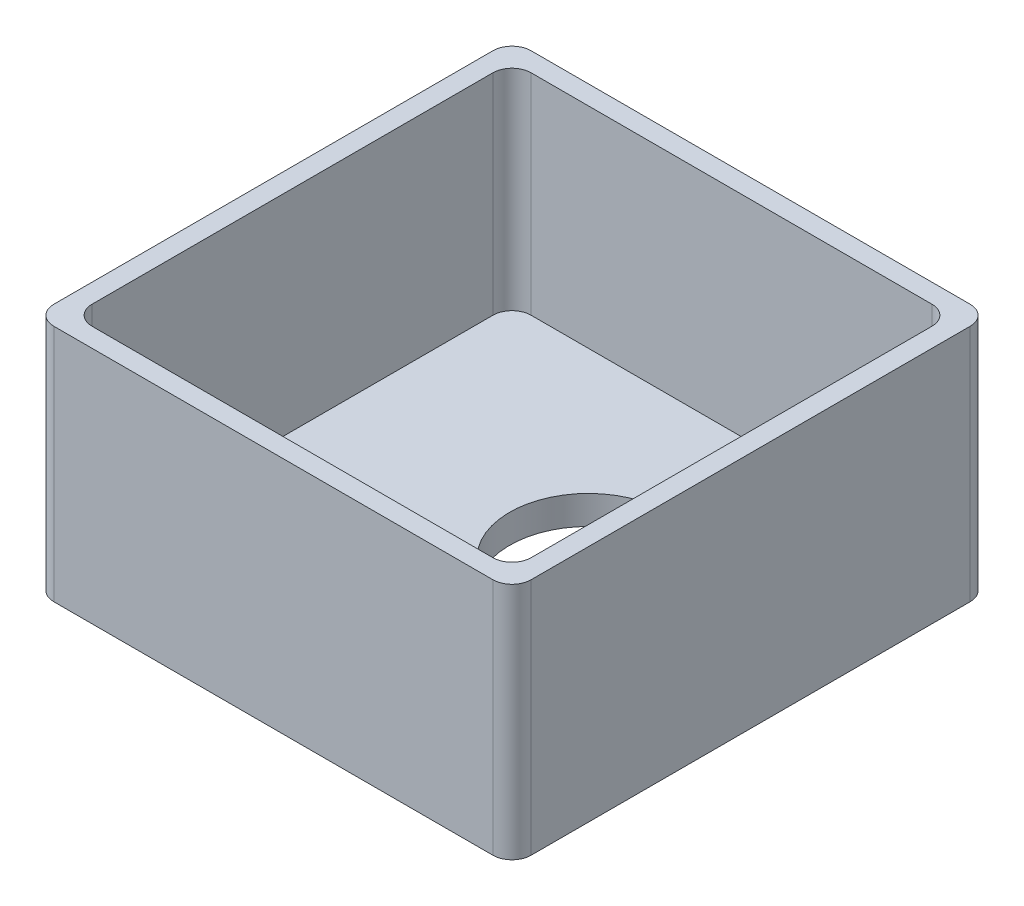
ISO-10303-21;
HEADER;
FILE_DESCRIPTION(('STEP AP214'),'2;1');
FILE_NAME('part.step','',(''),(''),'','','');
FILE_SCHEMA(('AUTOMOTIVE_DESIGN { 1 0 10303 214 1 1 1 1 }'));
ENDSEC;
DATA;
#1=APPLICATION_CONTEXT('core data for automotive mechanical design processes');
#2=APPLICATION_PROTOCOL_DEFINITION('international standard','automotive_design',2000,#1);
#3=PRODUCT_CONTEXT('',#1,'mechanical');
#4=PRODUCT('Part','Part','',(#3));
#5=PRODUCT_RELATED_PRODUCT_CATEGORY('part','',(#4));
#6=PRODUCT_DEFINITION_FORMATION('','',#4);
#7=PRODUCT_DEFINITION_CONTEXT('part definition',#1,'design');
#8=PRODUCT_DEFINITION('design','',#6,#7);
#9=PRODUCT_DEFINITION_SHAPE('','',#8);
#10=(LENGTH_UNIT() NAMED_UNIT(*) SI_UNIT(.MILLI.,.METRE.));
#11=(NAMED_UNIT(*) PLANE_ANGLE_UNIT() SI_UNIT($,.RADIAN.));
#12=(NAMED_UNIT(*) SI_UNIT($,.STERADIAN.) SOLID_ANGLE_UNIT());
#13=UNCERTAINTY_MEASURE_WITH_UNIT(LENGTH_MEASURE(1.E-05),#10,'distance_accuracy_value','');
#14=(GEOMETRIC_REPRESENTATION_CONTEXT(3) GLOBAL_UNCERTAINTY_ASSIGNED_CONTEXT((#13)) GLOBAL_UNIT_ASSIGNED_CONTEXT((#10,
#11,#12)) REPRESENTATION_CONTEXT('',''));
#15=CARTESIAN_POINT('',(0.,0.,0.));
#16=DIRECTION('',(0.,0.,1.));
#17=DIRECTION('',(1.,0.,0.));
#18=AXIS2_PLACEMENT_3D('',#15,#16,#17);
#19=CARTESIAN_POINT('',(0.,3.,25.));
#20=DIRECTION('',(0.,0.,-1.));
#21=DIRECTION('',(-1.,0.,0.));
#22=AXIS2_PLACEMENT_3D('',#19,#20,#21);
#23=PLANE('',#22);
#24=DIRECTION('',(1.,0.,0.));
#25=VECTOR('',#24,1.);
#26=CARTESIAN_POINT('',(-25.,25.,25.));
#27=LINE('',#26,#25);
#28=CARTESIAN_POINT('',(-23.,25.,25.));
#29=VERTEX_POINT('',#28);
#30=CARTESIAN_POINT('',(23.,25.,25.));
#31=VERTEX_POINT('',#30);
#32=EDGE_CURVE('E176',#29,#31,#27,.T.);
#33=ORIENTED_EDGE('',*,*,#32,.F.);
#34=DIRECTION('',(0.,-1.,0.));
#35=VECTOR('',#34,1.);
#36=CARTESIAN_POINT('',(-23.,0.,25.));
#37=LINE('',#36,#35);
#38=CARTESIAN_POINT('',(-23.,0.,25.));
#39=VERTEX_POINT('',#38);
#40=EDGE_CURVE('E160',#29,#39,#37,.T.);
#41=ORIENTED_EDGE('',*,*,#40,.T.);
#42=DIRECTION('',(1.,0.,0.));
#43=VECTOR('',#42,1.);
#44=CARTESIAN_POINT('',(0.,0.,25.));
#45=LINE('',#44,#43);
#46=CARTESIAN_POINT('',(23.,0.,25.));
#47=VERTEX_POINT('',#46);
#48=EDGE_CURVE('E173',#39,#47,#45,.T.);
#49=ORIENTED_EDGE('',*,*,#48,.T.);
#50=DIRECTION('',(0.,-1.,0.));
#51=VECTOR('',#50,1.);
#52=CARTESIAN_POINT('',(23.,3.,25.));
#53=LINE('',#52,#51);
#54=EDGE_CURVE('E179',#47,#31,#53,.F.);
#55=ORIENTED_EDGE('',*,*,#54,.T.);
#56=EDGE_LOOP('',(#33,#41,#49,#55));
#57=FACE_BOUND('',#56,.T.);
#58=ADVANCED_FACE('F41',(#57),#23,.F.);
#59=CARTESIAN_POINT('',(25.,3.,0.));
#60=DIRECTION('',(-1.,0.,0.));
#61=DIRECTION('',(0.,0.,1.));
#62=AXIS2_PLACEMENT_3D('',#59,#60,#61);
#63=PLANE('',#62);
#64=DIRECTION('',(0.,0.,-1.));
#65=VECTOR('',#64,1.);
#66=CARTESIAN_POINT('',(25.,25.,25.));
#67=LINE('',#66,#65);
#68=CARTESIAN_POINT('',(25.,25.,23.));
#69=VERTEX_POINT('',#68);
#70=CARTESIAN_POINT('',(25.,25.,-23.));
#71=VERTEX_POINT('',#70);
#72=EDGE_CURVE('E331',#69,#71,#67,.T.);
#73=ORIENTED_EDGE('',*,*,#72,.F.);
#74=DIRECTION('',(0.,-1.,0.));
#75=VECTOR('',#74,1.);
#76=CARTESIAN_POINT('',(25.,3.,23.));
#77=LINE('',#76,#75);
#78=CARTESIAN_POINT('',(25.,0.,23.));
#79=VERTEX_POINT('',#78);
#80=EDGE_CURVE('E259',#69,#79,#77,.T.);
#81=ORIENTED_EDGE('',*,*,#80,.T.);
#82=DIRECTION('',(0.,0.,-1.));
#83=VECTOR('',#82,1.);
#84=CARTESIAN_POINT('',(25.,0.,0.));
#85=LINE('',#84,#83);
#86=CARTESIAN_POINT('',(25.,0.,-23.));
#87=VERTEX_POINT('',#86);
#88=EDGE_CURVE('E185',#79,#87,#85,.T.);
#89=ORIENTED_EDGE('',*,*,#88,.T.);
#90=DIRECTION('',(0.,-1.,0.));
#91=VECTOR('',#90,1.);
#92=CARTESIAN_POINT('',(25.,25.,-23.));
#93=LINE('',#92,#91);
#94=EDGE_CURVE('E256',#87,#71,#93,.F.);
#95=ORIENTED_EDGE('',*,*,#94,.T.);
#96=EDGE_LOOP('',(#73,#81,#89,#95));
#97=FACE_BOUND('',#96,.T.);
#98=ADVANCED_FACE('F362',(#97),#63,.F.);
#99=CARTESIAN_POINT('',(0.,3.,-25.));
#100=DIRECTION('',(0.,0.,-1.));
#101=DIRECTION('',(-1.,0.,0.));
#102=AXIS2_PLACEMENT_3D('',#99,#100,#101);
#103=PLANE('',#102);
#104=DIRECTION('',(-1.,0.,0.));
#105=VECTOR('',#104,1.);
#106=CARTESIAN_POINT('',(-25.,25.,-25.));
#107=LINE('',#106,#105);
#108=CARTESIAN_POINT('',(23.,25.,-25.));
#109=VERTEX_POINT('',#108);
#110=CARTESIAN_POINT('',(-23.,25.,-25.));
#111=VERTEX_POINT('',#110);
#112=EDGE_CURVE('E335',#109,#111,#107,.T.);
#113=ORIENTED_EDGE('',*,*,#112,.F.);
#114=DIRECTION('',(0.,-1.,0.));
#115=VECTOR('',#114,1.);
#116=CARTESIAN_POINT('',(23.,0.,-25.));
#117=LINE('',#116,#115);
#118=CARTESIAN_POINT('',(23.,0.,-25.));
#119=VERTEX_POINT('',#118);
#120=EDGE_CURVE('E273',#109,#119,#117,.T.);
#121=ORIENTED_EDGE('',*,*,#120,.T.);
#122=DIRECTION('',(1.,0.,0.));
#123=VECTOR('',#122,1.);
#124=CARTESIAN_POINT('',(0.,0.,-25.));
#125=LINE('',#124,#123);
#126=CARTESIAN_POINT('',(-23.,0.,-25.));
#127=VERTEX_POINT('',#126);
#128=EDGE_CURVE('E190',#127,#119,#125,.T.);
#129=ORIENTED_EDGE('',*,*,#128,.F.);
#130=DIRECTION('',(0.,-1.,0.));
#131=VECTOR('',#130,1.);
#132=CARTESIAN_POINT('',(-23.,3.,-25.));
#133=LINE('',#132,#131);
#134=EDGE_CURVE('E270',#127,#111,#133,.F.);
#135=ORIENTED_EDGE('',*,*,#134,.T.);
#136=EDGE_LOOP('',(#113,#121,#129,#135));
#137=FACE_BOUND('',#136,.T.);
#138=ADVANCED_FACE('F354',(#137),#103,.T.);
#139=CARTESIAN_POINT('',(-25.,3.,0.));
#140=DIRECTION('',(-1.,0.,0.));
#141=DIRECTION('',(0.,0.,1.));
#142=AXIS2_PLACEMENT_3D('',#139,#140,#141);
#143=PLANE('',#142);
#144=DIRECTION('',(0.,0.,-1.));
#145=VECTOR('',#144,1.);
#146=CARTESIAN_POINT('',(-25.,0.,0.));
#147=LINE('',#146,#145);
#148=CARTESIAN_POINT('',(-25.,0.,23.));
#149=VERTEX_POINT('',#148);
#150=CARTESIAN_POINT('',(-25.,0.,-23.));
#151=VERTEX_POINT('',#150);
#152=EDGE_CURVE('E200',#149,#151,#147,.T.);
#153=ORIENTED_EDGE('',*,*,#152,.F.);
#154=DIRECTION('',(0.,-1.,0.));
#155=VECTOR('',#154,1.);
#156=CARTESIAN_POINT('',(-25.,25.,23.));
#157=LINE('',#156,#155);
#158=CARTESIAN_POINT('',(-25.,25.,23.));
#159=VERTEX_POINT('',#158);
#160=EDGE_CURVE('E161',#149,#159,#157,.F.);
#161=ORIENTED_EDGE('',*,*,#160,.T.);
#162=DIRECTION('',(0.,0.,1.));
#163=VECTOR('',#162,1.);
#164=CARTESIAN_POINT('',(-25.,25.,25.));
#165=LINE('',#164,#163);
#166=CARTESIAN_POINT('',(-25.,25.,-23.));
#167=VERTEX_POINT('',#166);
#168=EDGE_CURVE('E192',#167,#159,#165,.T.);
#169=ORIENTED_EDGE('',*,*,#168,.F.);
#170=DIRECTION('',(0.,-1.,0.));
#171=VECTOR('',#170,1.);
#172=CARTESIAN_POINT('',(-25.,3.,-23.));
#173=LINE('',#172,#171);
#174=EDGE_CURVE('E167',#167,#151,#173,.T.);
#175=ORIENTED_EDGE('',*,*,#174,.T.);
#176=EDGE_LOOP('',(#153,#161,#169,#175));
#177=FACE_BOUND('',#176,.T.);
#178=ADVANCED_FACE('F347',(#177),#143,.T.);
#179=CARTESIAN_POINT('',(4.,3.,-4.));
#180=DIRECTION('',(0.,-1.,0.));
#181=DIRECTION('',(0.,0.,-1.));
#182=AXIS2_PLACEMENT_3D('',#179,#180,#181);
#183=CYLINDRICAL_SURFACE('',#182,8.25);
#184=CARTESIAN_POINT('',(4.,3.,-4.));
#185=DIRECTION('',(0.,1.,0.));
#186=DIRECTION('',(0.,0.,1.));
#187=AXIS2_PLACEMENT_3D('',#184,#185,#186);
#188=CIRCLE('',#187,8.25);
#189=CARTESIAN_POINT('',(4.,3.,4.25));
#190=VERTEX_POINT('',#189);
#191=EDGE_CURVE('E195',#190,#190,#188,.T.);
#192=ORIENTED_EDGE('',*,*,#191,.T.);
#193=EDGE_LOOP('',(#192));
#194=FACE_BOUND('',#193,.T.);
#195=CARTESIAN_POINT('',(4.,0.,-4.));
#196=DIRECTION('',(0.,1.,0.));
#197=DIRECTION('',(0.,0.,1.));
#198=AXIS2_PLACEMENT_3D('',#195,#196,#197);
#199=CIRCLE('',#198,8.25);
#200=CARTESIAN_POINT('',(4.,0.,4.25));
#201=VERTEX_POINT('',#200);
#202=EDGE_CURVE('E203',#201,#201,#199,.T.);
#203=ORIENTED_EDGE('',*,*,#202,.F.);
#204=EDGE_LOOP('',(#203));
#205=FACE_BOUND('',#204,.T.);
#206=ADVANCED_FACE('F408',(#194,#205),#183,.F.);
#207=CARTESIAN_POINT('',(0.,3.,0.));
#208=DIRECTION('',(0.,1.,0.));
#209=DIRECTION('',(0.,0.,1.));
#210=AXIS2_PLACEMENT_3D('',#207,#208,#209);
#211=PLANE('',#210);
#212=DIRECTION('',(0.,0.,1.));
#213=VECTOR('',#212,1.);
#214=CARTESIAN_POINT('',(-23.,3.,23.));
#215=LINE('',#214,#213);
#216=CARTESIAN_POINT('',(-23.,3.,-21.));
#217=VERTEX_POINT('',#216);
#218=CARTESIAN_POINT('',(-23.,3.,21.));
#219=VERTEX_POINT('',#218);
#220=EDGE_CURVE('E321',#217,#219,#215,.T.);
#221=ORIENTED_EDGE('',*,*,#220,.T.);
#222=CARTESIAN_POINT('',(-21.,3.,21.));
#223=DIRECTION('',(0.,1.,0.));
#224=DIRECTION('',(0.,0.,1.));
#225=AXIS2_PLACEMENT_3D('',#222,#223,#224);
#226=CIRCLE('',#225,2.);
#227=CARTESIAN_POINT('',(-21.,3.,23.));
#228=VERTEX_POINT('',#227);
#229=EDGE_CURVE('E65',#219,#228,#226,.T.);
#230=ORIENTED_EDGE('',*,*,#229,.T.);
#231=DIRECTION('',(1.,0.,0.));
#232=VECTOR('',#231,1.);
#233=CARTESIAN_POINT('',(-23.,3.,23.));
#234=LINE('',#233,#232);
#235=CARTESIAN_POINT('',(21.,3.,23.));
#236=VERTEX_POINT('',#235);
#237=EDGE_CURVE('E308',#228,#236,#234,.T.);
#238=ORIENTED_EDGE('',*,*,#237,.T.);
#239=CARTESIAN_POINT('',(21.,3.,21.));
#240=DIRECTION('',(0.,1.,0.));
#241=DIRECTION('',(0.,0.,1.));
#242=AXIS2_PLACEMENT_3D('',#239,#240,#241);
#243=CIRCLE('',#242,2.);
#244=CARTESIAN_POINT('',(23.,3.,21.));
#245=VERTEX_POINT('',#244);
#246=EDGE_CURVE('E57',#236,#245,#243,.T.);
#247=ORIENTED_EDGE('',*,*,#246,.T.);
#248=DIRECTION('',(0.,0.,-1.));
#249=VECTOR('',#248,1.);
#250=CARTESIAN_POINT('',(23.,3.,23.));
#251=LINE('',#250,#249);
#252=CARTESIAN_POINT('',(23.,3.,-21.));
#253=VERTEX_POINT('',#252);
#254=EDGE_CURVE('E316',#245,#253,#251,.T.);
#255=ORIENTED_EDGE('',*,*,#254,.T.);
#256=CARTESIAN_POINT('',(21.,3.,-21.));
#257=DIRECTION('',(0.,1.,0.));
#258=DIRECTION('',(0.,0.,1.));
#259=AXIS2_PLACEMENT_3D('',#256,#257,#258);
#260=CIRCLE('',#259,2.);
#261=CARTESIAN_POINT('',(21.,3.,-23.));
#262=VERTEX_POINT('',#261);
#263=EDGE_CURVE('E243',#253,#262,#260,.T.);
#264=ORIENTED_EDGE('',*,*,#263,.T.);
#265=DIRECTION('',(-1.,0.,0.));
#266=VECTOR('',#265,1.);
#267=CARTESIAN_POINT('',(-23.,3.,-23.));
#268=LINE('',#267,#266);
#269=CARTESIAN_POINT('',(-21.,3.,-23.));
#270=VERTEX_POINT('',#269);
#271=EDGE_CURVE('E315',#262,#270,#268,.T.);
#272=ORIENTED_EDGE('',*,*,#271,.T.);
#273=CARTESIAN_POINT('',(-21.,3.,-21.));
#274=DIRECTION('',(0.,1.,0.));
#275=DIRECTION('',(0.,0.,1.));
#276=AXIS2_PLACEMENT_3D('',#273,#274,#275);
#277=CIRCLE('',#276,2.);
#278=EDGE_CURVE('E240',#270,#217,#277,.T.);
#279=ORIENTED_EDGE('',*,*,#278,.T.);
#280=EDGE_LOOP('',(#221,#230,#238,#247,#255,#264,#272,#279));
#281=FACE_BOUND('',#280,.T.);
#282=ORIENTED_EDGE('',*,*,#191,.F.);
#283=EDGE_LOOP('',(#282));
#284=FACE_BOUND('',#283,.T.);
#285=ADVANCED_FACE('F313',(#281,#284),#211,.T.);
#286=CARTESIAN_POINT('',(0.,0.,0.));
#287=DIRECTION('',(0.,1.,0.));
#288=DIRECTION('',(0.,0.,1.));
#289=AXIS2_PLACEMENT_3D('',#286,#287,#288);
#290=PLANE('',#289);
#291=ORIENTED_EDGE('',*,*,#48,.F.);
#292=CARTESIAN_POINT('',(-23.,0.,23.));
#293=DIRECTION('',(0.,1.,0.));
#294=DIRECTION('',(0.,0.,1.));
#295=AXIS2_PLACEMENT_3D('',#292,#293,#294);
#296=CIRCLE('',#295,2.);
#297=EDGE_CURVE('E156',#39,#149,#296,.F.);
#298=ORIENTED_EDGE('',*,*,#297,.T.);
#299=ORIENTED_EDGE('',*,*,#152,.T.);
#300=CARTESIAN_POINT('',(-23.,0.,-23.));
#301=DIRECTION('',(0.,1.,0.));
#302=DIRECTION('',(0.,0.,1.));
#303=AXIS2_PLACEMENT_3D('',#300,#301,#302);
#304=CIRCLE('',#303,2.);
#305=EDGE_CURVE('E178',#151,#127,#304,.F.);
#306=ORIENTED_EDGE('',*,*,#305,.T.);
#307=ORIENTED_EDGE('',*,*,#128,.T.);
#308=CARTESIAN_POINT('',(23.,0.,-23.));
#309=DIRECTION('',(0.,1.,0.));
#310=DIRECTION('',(0.,0.,1.));
#311=AXIS2_PLACEMENT_3D('',#308,#309,#310);
#312=CIRCLE('',#311,2.);
#313=EDGE_CURVE('E211',#119,#87,#312,.F.);
#314=ORIENTED_EDGE('',*,*,#313,.T.);
#315=ORIENTED_EDGE('',*,*,#88,.F.);
#316=CARTESIAN_POINT('',(23.,0.,23.));
#317=DIRECTION('',(0.,1.,0.));
#318=DIRECTION('',(0.,0.,1.));
#319=AXIS2_PLACEMENT_3D('',#316,#317,#318);
#320=CIRCLE('',#319,2.);
#321=EDGE_CURVE('E168',#79,#47,#320,.F.);
#322=ORIENTED_EDGE('',*,*,#321,.T.);
#323=EDGE_LOOP('',(#291,#298,#299,#306,#307,#314,#315,#322));
#324=FACE_BOUND('',#323,.T.);
#325=ORIENTED_EDGE('',*,*,#202,.T.);
#326=EDGE_LOOP('',(#325));
#327=FACE_BOUND('',#326,.T.);
#328=ADVANCED_FACE('F181',(#324,#327),#290,.F.);
#329=CARTESIAN_POINT('',(0.,25.,0.));
#330=DIRECTION('',(0.,-1.,0.));
#331=DIRECTION('',(0.,0.,-1.));
#332=AXIS2_PLACEMENT_3D('',#329,#330,#331);
#333=PLANE('',#332);
#334=ORIENTED_EDGE('',*,*,#168,.T.);
#335=CARTESIAN_POINT('',(-23.,25.,23.));
#336=DIRECTION('',(0.,-1.,0.));
#337=DIRECTION('',(0.,0.,-1.));
#338=AXIS2_PLACEMENT_3D('',#335,#336,#337);
#339=CIRCLE('',#338,2.);
#340=EDGE_CURVE('E230',#159,#29,#339,.F.);
#341=ORIENTED_EDGE('',*,*,#340,.T.);
#342=ORIENTED_EDGE('',*,*,#32,.T.);
#343=CARTESIAN_POINT('',(23.,25.,23.));
#344=DIRECTION('',(0.,-1.,0.));
#345=DIRECTION('',(0.,0.,-1.));
#346=AXIS2_PLACEMENT_3D('',#343,#344,#345);
#347=CIRCLE('',#346,2.);
#348=EDGE_CURVE('E227',#31,#69,#347,.F.);
#349=ORIENTED_EDGE('',*,*,#348,.T.);
#350=ORIENTED_EDGE('',*,*,#72,.T.);
#351=CARTESIAN_POINT('',(23.,25.,-23.));
#352=DIRECTION('',(0.,-1.,0.));
#353=DIRECTION('',(0.,0.,-1.));
#354=AXIS2_PLACEMENT_3D('',#351,#352,#353);
#355=CIRCLE('',#354,2.);
#356=EDGE_CURVE('E224',#71,#109,#355,.F.);
#357=ORIENTED_EDGE('',*,*,#356,.T.);
#358=ORIENTED_EDGE('',*,*,#112,.T.);
#359=CARTESIAN_POINT('',(-23.,25.,-23.));
#360=DIRECTION('',(0.,-1.,0.));
#361=DIRECTION('',(0.,0.,-1.));
#362=AXIS2_PLACEMENT_3D('',#359,#360,#361);
#363=CIRCLE('',#362,2.);
#364=EDGE_CURVE('E221',#111,#167,#363,.F.);
#365=ORIENTED_EDGE('',*,*,#364,.T.);
#366=EDGE_LOOP('',(#334,#341,#342,#349,#350,#357,#358,#365));
#367=FACE_BOUND('',#366,.T.);
#368=DIRECTION('',(0.,0.,-1.));
#369=VECTOR('',#368,1.);
#370=CARTESIAN_POINT('',(23.,25.,23.));
#371=LINE('',#370,#369);
#372=CARTESIAN_POINT('',(23.,25.,21.));
#373=VERTEX_POINT('',#372);
#374=CARTESIAN_POINT('',(23.,25.,-21.));
#375=VERTEX_POINT('',#374);
#376=EDGE_CURVE('E296',#373,#375,#371,.T.);
#377=ORIENTED_EDGE('',*,*,#376,.F.);
#378=CARTESIAN_POINT('',(21.,25.,21.));
#379=DIRECTION('',(0.,-1.,0.));
#380=DIRECTION('',(0.,0.,-1.));
#381=AXIS2_PLACEMENT_3D('',#378,#379,#380);
#382=CIRCLE('',#381,2.);
#383=CARTESIAN_POINT('',(21.,25.,23.));
#384=VERTEX_POINT('',#383);
#385=EDGE_CURVE('E287',#373,#384,#382,.T.);
#386=ORIENTED_EDGE('',*,*,#385,.T.);
#387=DIRECTION('',(1.,0.,0.));
#388=VECTOR('',#387,1.);
#389=CARTESIAN_POINT('',(-23.,25.,23.));
#390=LINE('',#389,#388);
#391=CARTESIAN_POINT('',(-21.,25.,23.));
#392=VERTEX_POINT('',#391);
#393=EDGE_CURVE('E336',#392,#384,#390,.T.);
#394=ORIENTED_EDGE('',*,*,#393,.F.);
#395=CARTESIAN_POINT('',(-21.,25.,21.));
#396=DIRECTION('',(0.,-1.,0.));
#397=DIRECTION('',(0.,0.,-1.));
#398=AXIS2_PLACEMENT_3D('',#395,#396,#397);
#399=CIRCLE('',#398,2.);
#400=CARTESIAN_POINT('',(-23.,25.,21.));
#401=VERTEX_POINT('',#400);
#402=EDGE_CURVE('E284',#392,#401,#399,.T.);
#403=ORIENTED_EDGE('',*,*,#402,.T.);
#404=DIRECTION('',(0.,0.,1.));
#405=VECTOR('',#404,1.);
#406=CARTESIAN_POINT('',(-23.,25.,23.));
#407=LINE('',#406,#405);
#408=CARTESIAN_POINT('',(-23.,25.,-21.));
#409=VERTEX_POINT('',#408);
#410=EDGE_CURVE('E515',#409,#401,#407,.T.);
#411=ORIENTED_EDGE('',*,*,#410,.F.);
#412=CARTESIAN_POINT('',(-21.,25.,-21.));
#413=DIRECTION('',(0.,-1.,0.));
#414=DIRECTION('',(0.,0.,-1.));
#415=AXIS2_PLACEMENT_3D('',#412,#413,#414);
#416=CIRCLE('',#415,2.);
#417=CARTESIAN_POINT('',(-21.,25.,-23.));
#418=VERTEX_POINT('',#417);
#419=EDGE_CURVE('E11',#409,#418,#416,.T.);
#420=ORIENTED_EDGE('',*,*,#419,.T.);
#421=DIRECTION('',(-1.,0.,0.));
#422=VECTOR('',#421,1.);
#423=CARTESIAN_POINT('',(-23.,25.,-23.));
#424=LINE('',#423,#422);
#425=CARTESIAN_POINT('',(21.,25.,-23.));
#426=VERTEX_POINT('',#425);
#427=EDGE_CURVE('E299',#426,#418,#424,.T.);
#428=ORIENTED_EDGE('',*,*,#427,.F.);
#429=CARTESIAN_POINT('',(21.,25.,-21.));
#430=DIRECTION('',(0.,-1.,0.));
#431=DIRECTION('',(0.,0.,-1.));
#432=AXIS2_PLACEMENT_3D('',#429,#430,#431);
#433=CIRCLE('',#432,2.);
#434=EDGE_CURVE('E50',#426,#375,#433,.T.);
#435=ORIENTED_EDGE('',*,*,#434,.T.);
#436=EDGE_LOOP('',(#377,#386,#394,#403,#411,#420,#428,#435));
#437=FACE_BOUND('',#436,.T.);
#438=ADVANCED_FACE('F295',(#367,#437),#333,.F.);
#439=CARTESIAN_POINT('',(23.,25.,23.));
#440=DIRECTION('',(-1.,0.,0.));
#441=DIRECTION('',(0.,0.,1.));
#442=AXIS2_PLACEMENT_3D('',#439,#440,#441);
#443=PLANE('',#442);
#444=ORIENTED_EDGE('',*,*,#254,.F.);
#445=DIRECTION('',(0.,-1.,0.));
#446=VECTOR('',#445,1.);
#447=CARTESIAN_POINT('',(23.,25.,21.));
#448=LINE('',#447,#446);
#449=EDGE_CURVE('E267',#245,#373,#448,.F.);
#450=ORIENTED_EDGE('',*,*,#449,.T.);
#451=ORIENTED_EDGE('',*,*,#376,.T.);
#452=DIRECTION('',(0.,-1.,0.));
#453=VECTOR('',#452,1.);
#454=CARTESIAN_POINT('',(23.,3.,-21.));
#455=LINE('',#454,#453);
#456=EDGE_CURVE('E263',#375,#253,#455,.T.);
#457=ORIENTED_EDGE('',*,*,#456,.T.);
#458=EDGE_LOOP('',(#444,#450,#451,#457));
#459=FACE_BOUND('',#458,.T.);
#460=ADVANCED_FACE('F305',(#459),#443,.T.);
#461=CARTESIAN_POINT('',(-23.,25.,-23.));
#462=DIRECTION('',(0.,0.,1.));
#463=DIRECTION('',(1.,0.,0.));
#464=AXIS2_PLACEMENT_3D('',#461,#462,#463);
#465=PLANE('',#464);
#466=ORIENTED_EDGE('',*,*,#271,.F.);
#467=DIRECTION('',(0.,-1.,0.));
#468=VECTOR('',#467,1.);
#469=CARTESIAN_POINT('',(21.,25.,-23.));
#470=LINE('',#469,#468);
#471=EDGE_CURVE('E281',#262,#426,#470,.F.);
#472=ORIENTED_EDGE('',*,*,#471,.T.);
#473=ORIENTED_EDGE('',*,*,#427,.T.);
#474=DIRECTION('',(0.,-1.,0.));
#475=VECTOR('',#474,1.);
#476=CARTESIAN_POINT('',(-21.,3.,-23.));
#477=LINE('',#476,#475);
#478=EDGE_CURVE('E277',#418,#270,#477,.T.);
#479=ORIENTED_EDGE('',*,*,#478,.T.);
#480=EDGE_LOOP('',(#466,#472,#473,#479));
#481=FACE_BOUND('',#480,.T.);
#482=ADVANCED_FACE('F318',(#481),#465,.T.);
#483=CARTESIAN_POINT('',(-23.,25.,23.));
#484=DIRECTION('',(1.,0.,0.));
#485=DIRECTION('',(0.,0.,-1.));
#486=AXIS2_PLACEMENT_3D('',#483,#484,#485);
#487=PLANE('',#486);
#488=ORIENTED_EDGE('',*,*,#410,.T.);
#489=DIRECTION('',(0.,-1.,0.));
#490=VECTOR('',#489,1.);
#491=CARTESIAN_POINT('',(-23.,3.,21.));
#492=LINE('',#491,#490);
#493=EDGE_CURVE('E236',#401,#219,#492,.T.);
#494=ORIENTED_EDGE('',*,*,#493,.T.);
#495=ORIENTED_EDGE('',*,*,#220,.F.);
#496=DIRECTION('',(0.,-1.,0.));
#497=VECTOR('',#496,1.);
#498=CARTESIAN_POINT('',(-23.,25.,-21.));
#499=LINE('',#498,#497);
#500=EDGE_CURVE('E233',#217,#409,#499,.F.);
#501=ORIENTED_EDGE('',*,*,#500,.T.);
#502=EDGE_LOOP('',(#488,#494,#495,#501));
#503=FACE_BOUND('',#502,.T.);
#504=ADVANCED_FACE('F391',(#503),#487,.T.);
#505=CARTESIAN_POINT('',(-23.,25.,23.));
#506=DIRECTION('',(0.,0.,-1.));
#507=DIRECTION('',(-1.,0.,0.));
#508=AXIS2_PLACEMENT_3D('',#505,#506,#507);
#509=PLANE('',#508);
#510=ORIENTED_EDGE('',*,*,#237,.F.);
#511=DIRECTION('',(0.,-1.,0.));
#512=VECTOR('',#511,1.);
#513=CARTESIAN_POINT('',(-21.,25.,23.));
#514=LINE('',#513,#512);
#515=EDGE_CURVE('E253',#228,#392,#514,.F.);
#516=ORIENTED_EDGE('',*,*,#515,.T.);
#517=ORIENTED_EDGE('',*,*,#393,.T.);
#518=DIRECTION('',(0.,-1.,0.));
#519=VECTOR('',#518,1.);
#520=CARTESIAN_POINT('',(21.,3.,23.));
#521=LINE('',#520,#519);
#522=EDGE_CURVE('E250',#384,#236,#521,.T.);
#523=ORIENTED_EDGE('',*,*,#522,.T.);
#524=EDGE_LOOP('',(#510,#516,#517,#523));
#525=FACE_BOUND('',#524,.T.);
#526=ADVANCED_FACE('F387',(#525),#509,.T.);
#527=CARTESIAN_POINT('',(-23.,3.,23.));
#528=DIRECTION('',(0.,1.,0.));
#529=DIRECTION('',(0.,0.,1.));
#530=AXIS2_PLACEMENT_3D('',#527,#528,#529);
#531=CYLINDRICAL_SURFACE('',#530,2.);
#532=ORIENTED_EDGE('',*,*,#340,.F.);
#533=ORIENTED_EDGE('',*,*,#160,.F.);
#534=ORIENTED_EDGE('',*,*,#297,.F.);
#535=ORIENTED_EDGE('',*,*,#40,.F.);
#536=EDGE_LOOP('',(#532,#533,#534,#535));
#537=FACE_BOUND('',#536,.T.);
#538=ADVANCED_FACE('F159',(#537),#531,.T.);
#539=CARTESIAN_POINT('',(-21.,25.,21.));
#540=DIRECTION('',(0.,1.,0.));
#541=DIRECTION('',(0.,0.,1.));
#542=AXIS2_PLACEMENT_3D('',#539,#540,#541);
#543=CYLINDRICAL_SURFACE('',#542,2.);
#544=ORIENTED_EDGE('',*,*,#402,.F.);
#545=ORIENTED_EDGE('',*,*,#515,.F.);
#546=ORIENTED_EDGE('',*,*,#229,.F.);
#547=ORIENTED_EDGE('',*,*,#493,.F.);
#548=EDGE_LOOP('',(#544,#545,#546,#547));
#549=FACE_BOUND('',#548,.T.);
#550=ADVANCED_FACE('F369',(#549),#543,.F.);
#551=CARTESIAN_POINT('',(23.,3.,23.));
#552=DIRECTION('',(0.,-1.,0.));
#553=DIRECTION('',(0.,0.,-1.));
#554=AXIS2_PLACEMENT_3D('',#551,#552,#553);
#555=CYLINDRICAL_SURFACE('',#554,2.);
#556=ORIENTED_EDGE('',*,*,#348,.F.);
#557=ORIENTED_EDGE('',*,*,#54,.F.);
#558=ORIENTED_EDGE('',*,*,#321,.F.);
#559=ORIENTED_EDGE('',*,*,#80,.F.);
#560=EDGE_LOOP('',(#556,#557,#558,#559));
#561=FACE_BOUND('',#560,.T.);
#562=ADVANCED_FACE('F366',(#561),#555,.T.);
#563=CARTESIAN_POINT('',(21.,25.,21.));
#564=DIRECTION('',(0.,1.,0.));
#565=DIRECTION('',(0.,0.,1.));
#566=AXIS2_PLACEMENT_3D('',#563,#564,#565);
#567=CYLINDRICAL_SURFACE('',#566,2.);
#568=ORIENTED_EDGE('',*,*,#385,.F.);
#569=ORIENTED_EDGE('',*,*,#449,.F.);
#570=ORIENTED_EDGE('',*,*,#246,.F.);
#571=ORIENTED_EDGE('',*,*,#522,.F.);
#572=EDGE_LOOP('',(#568,#569,#570,#571));
#573=FACE_BOUND('',#572,.T.);
#574=ADVANCED_FACE('F368',(#573),#567,.F.);
#575=CARTESIAN_POINT('',(23.,3.,-23.));
#576=DIRECTION('',(0.,1.,0.));
#577=DIRECTION('',(0.,0.,1.));
#578=AXIS2_PLACEMENT_3D('',#575,#576,#577);
#579=CYLINDRICAL_SURFACE('',#578,2.);
#580=ORIENTED_EDGE('',*,*,#356,.F.);
#581=ORIENTED_EDGE('',*,*,#94,.F.);
#582=ORIENTED_EDGE('',*,*,#313,.F.);
#583=ORIENTED_EDGE('',*,*,#120,.F.);
#584=EDGE_LOOP('',(#580,#581,#582,#583));
#585=FACE_BOUND('',#584,.T.);
#586=ADVANCED_FACE('F358',(#585),#579,.T.);
#587=CARTESIAN_POINT('',(21.,25.,-21.));
#588=DIRECTION('',(0.,1.,0.));
#589=DIRECTION('',(0.,0.,1.));
#590=AXIS2_PLACEMENT_3D('',#587,#588,#589);
#591=CYLINDRICAL_SURFACE('',#590,2.);
#592=ORIENTED_EDGE('',*,*,#434,.F.);
#593=ORIENTED_EDGE('',*,*,#471,.F.);
#594=ORIENTED_EDGE('',*,*,#263,.F.);
#595=ORIENTED_EDGE('',*,*,#456,.F.);
#596=EDGE_LOOP('',(#592,#593,#594,#595));
#597=FACE_BOUND('',#596,.T.);
#598=ADVANCED_FACE('F310',(#597),#591,.F.);
#599=CARTESIAN_POINT('',(-23.,3.,-23.));
#600=DIRECTION('',(0.,-1.,0.));
#601=DIRECTION('',(0.,0.,-1.));
#602=AXIS2_PLACEMENT_3D('',#599,#600,#601);
#603=CYLINDRICAL_SURFACE('',#602,2.);
#604=ORIENTED_EDGE('',*,*,#364,.F.);
#605=ORIENTED_EDGE('',*,*,#134,.F.);
#606=ORIENTED_EDGE('',*,*,#305,.F.);
#607=ORIENTED_EDGE('',*,*,#174,.F.);
#608=EDGE_LOOP('',(#604,#605,#606,#607));
#609=FACE_BOUND('',#608,.T.);
#610=ADVANCED_FACE('F349',(#609),#603,.T.);
#611=CARTESIAN_POINT('',(-21.,25.,-21.));
#612=DIRECTION('',(0.,1.,0.));
#613=DIRECTION('',(0.,0.,1.));
#614=AXIS2_PLACEMENT_3D('',#611,#612,#613);
#615=CYLINDRICAL_SURFACE('',#614,2.);
#616=ORIENTED_EDGE('',*,*,#419,.F.);
#617=ORIENTED_EDGE('',*,*,#500,.F.);
#618=ORIENTED_EDGE('',*,*,#278,.F.);
#619=ORIENTED_EDGE('',*,*,#478,.F.);
#620=EDGE_LOOP('',(#616,#617,#618,#619));
#621=FACE_BOUND('',#620,.T.);
#622=ADVANCED_FACE('F43',(#621),#615,.F.);
#623=CLOSED_SHELL('',(#58,#98,#138,#178,#206,#285,#328,#438,#460,#482,#504,#526,#538,#550,#562,
#574,#586,#598,#610,#622));
#624=MANIFOLD_SOLID_BREP('B2',#623);
#625=ADVANCED_BREP_SHAPE_REPRESENTATION('',(#18,#624),#14);
#626=SHAPE_DEFINITION_REPRESENTATION(#9,#625);
ENDSEC;
END-ISO-10303-21;
